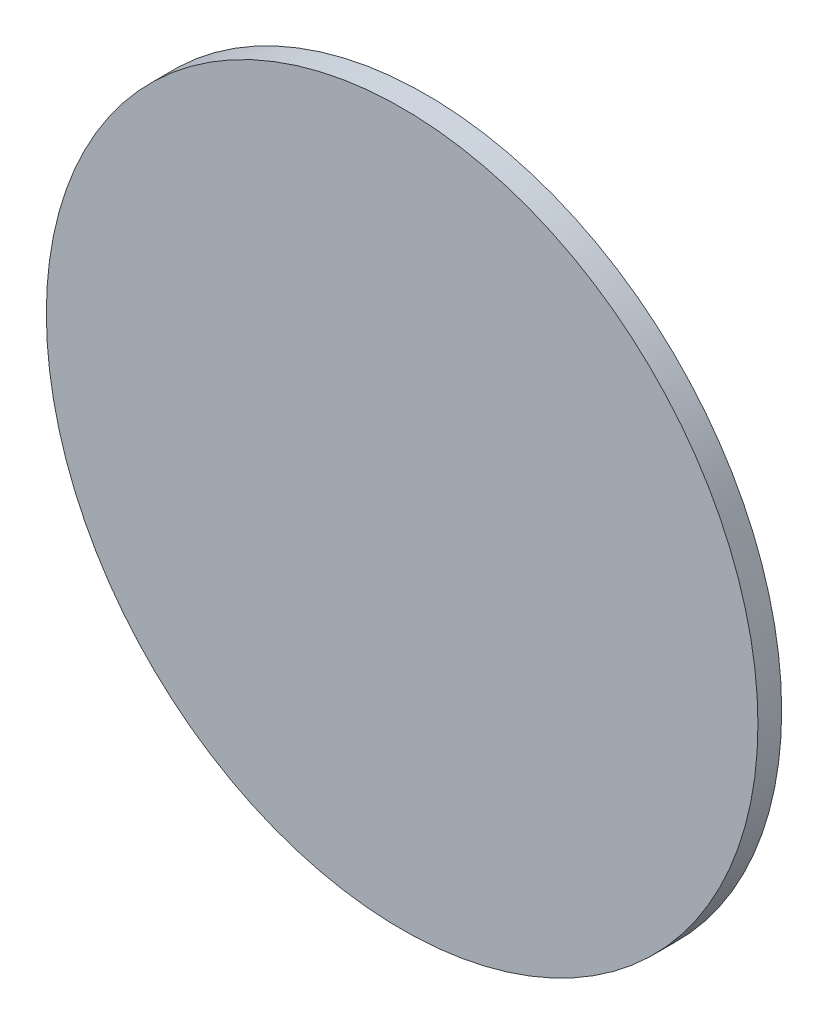
ISO-10303-21;
HEADER;
FILE_DESCRIPTION(('STEP AP214'),'2;1');
FILE_NAME('part.step','',(''),(''),'','','');
FILE_SCHEMA(('AUTOMOTIVE_DESIGN { 1 0 10303 214 1 1 1 1 }'));
ENDSEC;
DATA;
#1=APPLICATION_CONTEXT('core data for automotive mechanical design processes');
#2=APPLICATION_PROTOCOL_DEFINITION('international standard','automotive_design',2000,#1);
#3=PRODUCT_CONTEXT('',#1,'mechanical');
#4=PRODUCT('Part','Part','',(#3));
#5=PRODUCT_RELATED_PRODUCT_CATEGORY('part','',(#4));
#6=PRODUCT_DEFINITION_FORMATION('','',#4);
#7=PRODUCT_DEFINITION_CONTEXT('part definition',#1,'design');
#8=PRODUCT_DEFINITION('design','',#6,#7);
#9=PRODUCT_DEFINITION_SHAPE('','',#8);
#10=(LENGTH_UNIT() NAMED_UNIT(*) SI_UNIT(.MILLI.,.METRE.));
#11=(NAMED_UNIT(*) PLANE_ANGLE_UNIT() SI_UNIT($,.RADIAN.));
#12=(NAMED_UNIT(*) SI_UNIT($,.STERADIAN.) SOLID_ANGLE_UNIT());
#13=UNCERTAINTY_MEASURE_WITH_UNIT(LENGTH_MEASURE(1.E-05),#10,'distance_accuracy_value','');
#14=(GEOMETRIC_REPRESENTATION_CONTEXT(3) GLOBAL_UNCERTAINTY_ASSIGNED_CONTEXT((#13)) GLOBAL_UNIT_ASSIGNED_CONTEXT((#10,
#11,#12)) REPRESENTATION_CONTEXT('',''));
#15=CARTESIAN_POINT('',(0.,0.,0.));
#16=DIRECTION('',(0.,0.,1.));
#17=DIRECTION('',(1.,0.,0.));
#18=AXIS2_PLACEMENT_3D('',#15,#16,#17);
#19=CARTESIAN_POINT('',(0.1499997,0.,0.00999998));
#20=DIRECTION('',(0.,0.,-1.));
#21=DIRECTION('',(0.,-1.,0.));
#22=AXIS2_PLACEMENT_3D('',#19,#20,#21);
#23=PLANE('',#22);
#24=CARTESIAN_POINT('',(0.,0.,0.00999998));
#25=DIRECTION('',(0.,0.,1.));
#26=DIRECTION('',(1.,0.,0.));
#27=AXIS2_PLACEMENT_3D('',#24,#25,#26);
#28=CIRCLE('',#27,0.1499997);
#29=CARTESIAN_POINT('',(0.1499997,0.,0.00999998));
#30=VERTEX_POINT('',#29);
#31=EDGE_CURVE('E11',#30,#30,#28,.T.);
#32=ORIENTED_EDGE('',*,*,#31,.T.);
#33=EDGE_LOOP('',(#32));
#34=FACE_BOUND('',#33,.T.);
#35=ADVANCED_FACE('F17',(#34),#23,.F.);
#36=CARTESIAN_POINT('',(0.1499997,0.,0.));
#37=DIRECTION('',(0.,0.,-1.));
#38=DIRECTION('',(0.,-1.,0.));
#39=AXIS2_PLACEMENT_3D('',#36,#37,#38);
#40=PLANE('',#39);
#41=CARTESIAN_POINT('',(0.,0.,0.));
#42=DIRECTION('',(0.,0.,1.));
#43=DIRECTION('',(1.,0.,0.));
#44=AXIS2_PLACEMENT_3D('',#41,#42,#43);
#45=CIRCLE('',#44,0.1499997);
#46=CARTESIAN_POINT('',(0.1499997,0.,0.));
#47=VERTEX_POINT('',#46);
#48=EDGE_CURVE('E42',#47,#47,#45,.T.);
#49=ORIENTED_EDGE('',*,*,#48,.F.);
#50=EDGE_LOOP('',(#49));
#51=FACE_BOUND('',#50,.T.);
#52=ADVANCED_FACE('F64',(#51),#40,.T.);
#53=CARTESIAN_POINT('',(0.,0.,0.));
#54=DIRECTION('',(0.,0.,-1.));
#55=DIRECTION('',(1.,0.,0.));
#56=AXIS2_PLACEMENT_3D('',#53,#54,#55);
#57=CYLINDRICAL_SURFACE('',#56,0.1499997);
#58=ORIENTED_EDGE('',*,*,#48,.T.);
#59=DIRECTION('',(0.,0.,1.));
#60=VECTOR('',#59,1.);
#61=CARTESIAN_POINT('',(0.1499997,0.,0.));
#62=LINE('',#61,#60);
#63=EDGE_CURVE('E25',#47,#30,#62,.T.);
#64=ORIENTED_EDGE('',*,*,#63,.T.);
#65=ORIENTED_EDGE('',*,*,#31,.F.);
#66=ORIENTED_EDGE('',*,*,#63,.F.);
#67=EDGE_LOOP('',(#58,#64,#65,#66));
#68=FACE_BOUND('',#67,.T.);
#69=ADVANCED_FACE('F40',(#68),#57,.T.);
#70=CLOSED_SHELL('',(#35,#52,#69));
#71=MANIFOLD_SOLID_BREP('B1',#70);
#72=ADVANCED_BREP_SHAPE_REPRESENTATION('',(#18,#71),#14);
#73=SHAPE_DEFINITION_REPRESENTATION(#9,#72);
ENDSEC;
END-ISO-10303-21;
